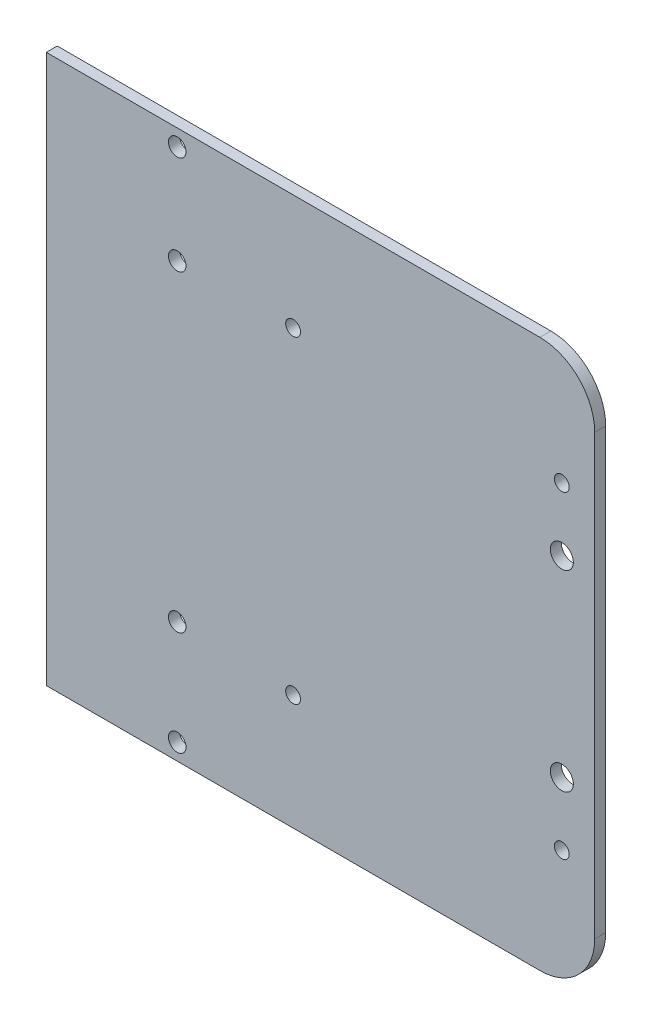
ISO-10303-21;
HEADER;
FILE_DESCRIPTION(('STEP AP214'),'2;1');
FILE_NAME('part.step','',(''),(''),'','','');
FILE_SCHEMA(('AUTOMOTIVE_DESIGN { 1 0 10303 214 1 1 1 1 }'));
ENDSEC;
DATA;
#1=APPLICATION_CONTEXT('core data for automotive mechanical design processes');
#2=APPLICATION_PROTOCOL_DEFINITION('international standard','automotive_design',2000,#1);
#3=PRODUCT_CONTEXT('',#1,'mechanical');
#4=PRODUCT('Part','Part','',(#3));
#5=PRODUCT_RELATED_PRODUCT_CATEGORY('part','',(#4));
#6=PRODUCT_DEFINITION_FORMATION('','',#4);
#7=PRODUCT_DEFINITION_CONTEXT('part definition',#1,'design');
#8=PRODUCT_DEFINITION('design','',#6,#7);
#9=PRODUCT_DEFINITION_SHAPE('','',#8);
#10=(LENGTH_UNIT() NAMED_UNIT(*) SI_UNIT(.MILLI.,.METRE.));
#11=(NAMED_UNIT(*) PLANE_ANGLE_UNIT() SI_UNIT($,.RADIAN.));
#12=(NAMED_UNIT(*) SI_UNIT($,.STERADIAN.) SOLID_ANGLE_UNIT());
#13=UNCERTAINTY_MEASURE_WITH_UNIT(LENGTH_MEASURE(1.E-05),#10,'distance_accuracy_value','');
#14=(GEOMETRIC_REPRESENTATION_CONTEXT(3) GLOBAL_UNCERTAINTY_ASSIGNED_CONTEXT((#13)) GLOBAL_UNIT_ASSIGNED_CONTEXT((#10,
#11,#12)) REPRESENTATION_CONTEXT('',''));
#15=CARTESIAN_POINT('',(0.,0.,0.));
#16=DIRECTION('',(0.,0.,1.));
#17=DIRECTION('',(1.,0.,0.));
#18=AXIS2_PLACEMENT_3D('',#15,#16,#17);
#19=CARTESIAN_POINT('',(40.,-40.,2.));
#20=DIRECTION('',(0.,0.,-1.));
#21=DIRECTION('',(-1.,0.,0.));
#22=AXIS2_PLACEMENT_3D('',#19,#20,#21);
#23=PLANE('',#22);
#24=CARTESIAN_POINT('',(-26.1250000000126,-47.,2.));
#25=DIRECTION('',(0.,0.,-1.));
#26=DIRECTION('',(-1.,0.,0.));
#27=AXIS2_PLACEMENT_3D('',#24,#25,#26);
#28=CIRCLE('',#27,1.6);
#29=CARTESIAN_POINT('',(-27.7250000000126,-47.,2.));
#30=VERTEX_POINT('',#29);
#31=EDGE_CURVE('E163',#30,#30,#28,.T.);
#32=ORIENTED_EDGE('',*,*,#31,.T.);
#33=EDGE_LOOP('',(#32));
#34=FACE_BOUND('',#33,.T.);
#35=CARTESIAN_POINT('',(-26.1250000000126,-28.0000000000001,2.));
#36=DIRECTION('',(0.,0.,-1.));
#37=DIRECTION('',(-1.,0.,0.));
#38=AXIS2_PLACEMENT_3D('',#35,#36,#37);
#39=CIRCLE('',#38,1.6);
#40=CARTESIAN_POINT('',(-27.7250000000126,-28.0000000000001,2.));
#41=VERTEX_POINT('',#40);
#42=EDGE_CURVE('E263',#41,#41,#39,.T.);
#43=ORIENTED_EDGE('',*,*,#42,.T.);
#44=EDGE_LOOP('',(#43));
#45=FACE_BOUND('',#44,.T.);
#46=CARTESIAN_POINT('',(-26.1250000000118,29.,2.));
#47=DIRECTION('',(0.,0.,-1.));
#48=DIRECTION('',(-1.,0.,0.));
#49=AXIS2_PLACEMENT_3D('',#46,#47,#48);
#50=CIRCLE('',#49,1.6);
#51=CARTESIAN_POINT('',(-27.7250000000118,29.,2.));
#52=VERTEX_POINT('',#51);
#53=EDGE_CURVE('E278',#52,#52,#50,.T.);
#54=ORIENTED_EDGE('',*,*,#53,.T.);
#55=EDGE_LOOP('',(#54));
#56=FACE_BOUND('',#55,.T.);
#57=CARTESIAN_POINT('',(-26.1250000000118,47.,2.));
#58=DIRECTION('',(0.,0.,-1.));
#59=DIRECTION('',(-1.,0.,0.));
#60=AXIS2_PLACEMENT_3D('',#57,#58,#59);
#61=CIRCLE('',#60,1.6);
#62=CARTESIAN_POINT('',(-27.7250000000118,47.,2.));
#63=VERTEX_POINT('',#62);
#64=EDGE_CURVE('E283',#63,#63,#61,.T.);
#65=ORIENTED_EDGE('',*,*,#64,.T.);
#66=EDGE_LOOP('',(#65));
#67=FACE_BOUND('',#66,.T.);
#68=CARTESIAN_POINT('',(44.,-29.,2.));
#69=DIRECTION('',(0.,0.,1.));
#70=DIRECTION('',(1.,0.,0.));
#71=AXIS2_PLACEMENT_3D('',#68,#69,#70);
#72=CIRCLE('',#71,1.35000000000001);
#73=CARTESIAN_POINT('',(45.35,-29.,2.));
#74=VERTEX_POINT('',#73);
#75=EDGE_CURVE('E156',#74,#74,#72,.F.);
#76=ORIENTED_EDGE('',*,*,#75,.T.);
#77=EDGE_LOOP('',(#76));
#78=FACE_BOUND('',#77,.T.);
#79=CARTESIAN_POINT('',(-4.99999999999998,29.,2.));
#80=DIRECTION('',(0.,0.,1.));
#81=DIRECTION('',(1.,0.,0.));
#82=AXIS2_PLACEMENT_3D('',#79,#80,#81);
#83=CIRCLE('',#82,1.35000000000001);
#84=CARTESIAN_POINT('',(-3.64999999999998,29.,2.));
#85=VERTEX_POINT('',#84);
#86=EDGE_CURVE('E174',#85,#85,#83,.F.);
#87=ORIENTED_EDGE('',*,*,#86,.T.);
#88=EDGE_LOOP('',(#87));
#89=FACE_BOUND('',#88,.T.);
#90=DIRECTION('',(0.,-1.,0.));
#91=VECTOR('',#90,1.);
#92=CARTESIAN_POINT('',(-50.,50.,2.));
#93=LINE('',#92,#91);
#94=CARTESIAN_POINT('',(-50.,50.,2.));
#95=VERTEX_POINT('',#94);
#96=CARTESIAN_POINT('',(-50.,-50.,2.));
#97=VERTEX_POINT('',#96);
#98=EDGE_CURVE('E143',#95,#97,#93,.T.);
#99=ORIENTED_EDGE('',*,*,#98,.T.);
#100=DIRECTION('',(1.,0.,0.));
#101=VECTOR('',#100,1.);
#102=CARTESIAN_POINT('',(-50.,-50.,2.));
#103=LINE('',#102,#101);
#104=CARTESIAN_POINT('',(39.9999999999999,-50.,2.));
#105=VERTEX_POINT('',#104);
#106=EDGE_CURVE('E93',#97,#105,#103,.T.);
#107=ORIENTED_EDGE('',*,*,#106,.T.);
#108=CARTESIAN_POINT('',(40.,-40.,2.));
#109=DIRECTION('',(0.,0.,1.));
#110=DIRECTION('',(-1.,0.,0.));
#111=AXIS2_PLACEMENT_3D('',#108,#109,#110);
#112=CIRCLE('',#111,10.);
#113=CARTESIAN_POINT('',(50.,-39.9999999999999,2.));
#114=VERTEX_POINT('',#113);
#115=EDGE_CURVE('E106',#105,#114,#112,.T.);
#116=ORIENTED_EDGE('',*,*,#115,.T.);
#117=DIRECTION('',(0.,1.,0.));
#118=VECTOR('',#117,1.);
#119=CARTESIAN_POINT('',(50.,39.9999999999999,2.));
#120=LINE('',#119,#118);
#121=CARTESIAN_POINT('',(50.,39.9999999999999,2.));
#122=VERTEX_POINT('',#121);
#123=EDGE_CURVE('E100',#114,#122,#120,.T.);
#124=ORIENTED_EDGE('',*,*,#123,.T.);
#125=CARTESIAN_POINT('',(40.,40.,2.));
#126=DIRECTION('',(0.,0.,1.));
#127=DIRECTION('',(-1.,0.,0.));
#128=AXIS2_PLACEMENT_3D('',#125,#126,#127);
#129=CIRCLE('',#128,10.);
#130=CARTESIAN_POINT('',(39.9999999999999,50.,2.));
#131=VERTEX_POINT('',#130);
#132=EDGE_CURVE('E104',#122,#131,#129,.T.);
#133=ORIENTED_EDGE('',*,*,#132,.T.);
#134=DIRECTION('',(-1.,0.,0.));
#135=VECTOR('',#134,1.);
#136=CARTESIAN_POINT('',(-50.,50.,2.));
#137=LINE('',#136,#135);
#138=EDGE_CURVE('E56',#131,#95,#137,.T.);
#139=ORIENTED_EDGE('',*,*,#138,.T.);
#140=EDGE_LOOP('',(#99,#107,#116,#124,#133,#139));
#141=FACE_BOUND('',#140,.T.);
#142=CARTESIAN_POINT('',(-4.99999999999998,-29.,2.));
#143=DIRECTION('',(0.,0.,1.));
#144=DIRECTION('',(1.,0.,0.));
#145=AXIS2_PLACEMENT_3D('',#142,#143,#144);
#146=CIRCLE('',#145,1.35000000000001);
#147=CARTESIAN_POINT('',(-3.64999999999998,-29.,2.));
#148=VERTEX_POINT('',#147);
#149=EDGE_CURVE('E173',#148,#148,#146,.T.);
#150=ORIENTED_EDGE('',*,*,#149,.F.);
#151=EDGE_LOOP('',(#150));
#152=FACE_BOUND('',#151,.T.);
#153=CARTESIAN_POINT('',(44.,29.,2.));
#154=DIRECTION('',(0.,0.,1.));
#155=DIRECTION('',(1.,0.,0.));
#156=AXIS2_PLACEMENT_3D('',#153,#154,#155);
#157=CIRCLE('',#156,1.35000000000001);
#158=CARTESIAN_POINT('',(45.35,29.,2.));
#159=VERTEX_POINT('',#158);
#160=EDGE_CURVE('E181',#159,#159,#157,.T.);
#161=ORIENTED_EDGE('',*,*,#160,.F.);
#162=EDGE_LOOP('',(#161));
#163=FACE_BOUND('',#162,.T.);
#164=CARTESIAN_POINT('',(44.,-17.5,2.));
#165=DIRECTION('',(0.,0.,1.));
#166=DIRECTION('',(1.,0.,0.));
#167=AXIS2_PLACEMENT_3D('',#164,#165,#166);
#168=CIRCLE('',#167,2.09999999999999);
#169=CARTESIAN_POINT('',(46.1,-17.5,2.));
#170=VERTEX_POINT('',#169);
#171=EDGE_CURVE('E158',#170,#170,#168,.F.);
#172=ORIENTED_EDGE('',*,*,#171,.T.);
#173=EDGE_LOOP('',(#172));
#174=FACE_BOUND('',#173,.T.);
#175=CARTESIAN_POINT('',(44.,17.5,2.));
#176=DIRECTION('',(0.,0.,1.));
#177=DIRECTION('',(1.,0.,0.));
#178=AXIS2_PLACEMENT_3D('',#175,#176,#177);
#179=CIRCLE('',#178,2.1);
#180=CARTESIAN_POINT('',(46.1,17.5,2.));
#181=VERTEX_POINT('',#180);
#182=EDGE_CURVE('E152',#181,#181,#179,.T.);
#183=ORIENTED_EDGE('',*,*,#182,.F.);
#184=EDGE_LOOP('',(#183));
#185=FACE_BOUND('',#184,.T.);
#186=ADVANCED_FACE('F36',(#34,#45,#56,#67,#78,#89,#141,#152,#163,#174,#185),#23,.F.);
#187=CARTESIAN_POINT('',(40.,-40.,0.));
#188=DIRECTION('',(0.,0.,-1.));
#189=DIRECTION('',(-1.,0.,0.));
#190=AXIS2_PLACEMENT_3D('',#187,#188,#189);
#191=PLANE('',#190);
#192=CARTESIAN_POINT('',(-26.1250000000126,-47.,0.));
#193=DIRECTION('',(0.,0.,-1.));
#194=DIRECTION('',(-1.,0.,0.));
#195=AXIS2_PLACEMENT_3D('',#192,#193,#194);
#196=CIRCLE('',#195,1.6);
#197=CARTESIAN_POINT('',(-27.7250000000126,-47.,0.));
#198=VERTEX_POINT('',#197);
#199=EDGE_CURVE('E262',#198,#198,#196,.T.);
#200=ORIENTED_EDGE('',*,*,#199,.F.);
#201=EDGE_LOOP('',(#200));
#202=FACE_BOUND('',#201,.T.);
#203=CARTESIAN_POINT('',(-26.1250000000126,-28.0000000000001,0.));
#204=DIRECTION('',(0.,0.,-1.));
#205=DIRECTION('',(-1.,0.,0.));
#206=AXIS2_PLACEMENT_3D('',#203,#204,#205);
#207=CIRCLE('',#206,1.6);
#208=CARTESIAN_POINT('',(-27.7250000000126,-28.0000000000001,0.));
#209=VERTEX_POINT('',#208);
#210=EDGE_CURVE('E267',#209,#209,#207,.T.);
#211=ORIENTED_EDGE('',*,*,#210,.F.);
#212=EDGE_LOOP('',(#211));
#213=FACE_BOUND('',#212,.T.);
#214=CARTESIAN_POINT('',(-26.1250000000118,29.,0.));
#215=DIRECTION('',(0.,0.,-1.));
#216=DIRECTION('',(-1.,0.,0.));
#217=AXIS2_PLACEMENT_3D('',#214,#215,#216);
#218=CIRCLE('',#217,1.6);
#219=CARTESIAN_POINT('',(-27.7250000000118,29.,0.));
#220=VERTEX_POINT('',#219);
#221=EDGE_CURVE('E280',#220,#220,#218,.T.);
#222=ORIENTED_EDGE('',*,*,#221,.F.);
#223=EDGE_LOOP('',(#222));
#224=FACE_BOUND('',#223,.T.);
#225=CARTESIAN_POINT('',(-26.1250000000118,47.,0.));
#226=DIRECTION('',(0.,0.,-1.));
#227=DIRECTION('',(-1.,0.,0.));
#228=AXIS2_PLACEMENT_3D('',#225,#226,#227);
#229=CIRCLE('',#228,1.6);
#230=CARTESIAN_POINT('',(-27.7250000000118,47.,0.));
#231=VERTEX_POINT('',#230);
#232=EDGE_CURVE('E166',#231,#231,#229,.T.);
#233=ORIENTED_EDGE('',*,*,#232,.F.);
#234=EDGE_LOOP('',(#233));
#235=FACE_BOUND('',#234,.T.);
#236=CARTESIAN_POINT('',(44.,-17.5,0.));
#237=DIRECTION('',(0.,0.,-1.));
#238=DIRECTION('',(-1.,0.,0.));
#239=AXIS2_PLACEMENT_3D('',#236,#237,#238);
#240=CIRCLE('',#239,2.09999999999999);
#241=CARTESIAN_POINT('',(41.9,-17.5,0.));
#242=VERTEX_POINT('',#241);
#243=EDGE_CURVE('E150',#242,#242,#240,.F.);
#244=ORIENTED_EDGE('',*,*,#243,.T.);
#245=EDGE_LOOP('',(#244));
#246=FACE_BOUND('',#245,.T.);
#247=CARTESIAN_POINT('',(-4.99999999999998,29.,0.));
#248=DIRECTION('',(0.,0.,1.));
#249=DIRECTION('',(1.,0.,0.));
#250=AXIS2_PLACEMENT_3D('',#247,#248,#249);
#251=CIRCLE('',#250,1.35000000000001);
#252=CARTESIAN_POINT('',(-3.64999999999998,29.,0.));
#253=VERTEX_POINT('',#252);
#254=EDGE_CURVE('E170',#253,#253,#251,.F.);
#255=ORIENTED_EDGE('',*,*,#254,.F.);
#256=EDGE_LOOP('',(#255));
#257=FACE_BOUND('',#256,.T.);
#258=CARTESIAN_POINT('',(-4.99999999999998,-29.,0.));
#259=DIRECTION('',(0.,0.,1.));
#260=DIRECTION('',(1.,0.,0.));
#261=AXIS2_PLACEMENT_3D('',#258,#259,#260);
#262=CIRCLE('',#261,1.35000000000001);
#263=CARTESIAN_POINT('',(-3.64999999999998,-29.,0.));
#264=VERTEX_POINT('',#263);
#265=EDGE_CURVE('E129',#264,#264,#262,.T.);
#266=ORIENTED_EDGE('',*,*,#265,.T.);
#267=EDGE_LOOP('',(#266));
#268=FACE_BOUND('',#267,.T.);
#269=DIRECTION('',(0.,-1.,0.));
#270=VECTOR('',#269,1.);
#271=CARTESIAN_POINT('',(-50.,50.,0.));
#272=LINE('',#271,#270);
#273=CARTESIAN_POINT('',(-50.,50.,0.));
#274=VERTEX_POINT('',#273);
#275=CARTESIAN_POINT('',(-50.,-50.,0.));
#276=VERTEX_POINT('',#275);
#277=EDGE_CURVE('E124',#274,#276,#272,.T.);
#278=ORIENTED_EDGE('',*,*,#277,.F.);
#279=DIRECTION('',(-1.,0.,0.));
#280=VECTOR('',#279,1.);
#281=CARTESIAN_POINT('',(-50.,50.,0.));
#282=LINE('',#281,#280);
#283=CARTESIAN_POINT('',(39.9999999999999,50.,0.));
#284=VERTEX_POINT('',#283);
#285=EDGE_CURVE('E85',#284,#274,#282,.T.);
#286=ORIENTED_EDGE('',*,*,#285,.F.);
#287=CARTESIAN_POINT('',(40.,40.,0.));
#288=DIRECTION('',(0.,0.,1.));
#289=DIRECTION('',(-1.,0.,0.));
#290=AXIS2_PLACEMENT_3D('',#287,#288,#289);
#291=CIRCLE('',#290,10.);
#292=CARTESIAN_POINT('',(50.,39.9999999999999,0.));
#293=VERTEX_POINT('',#292);
#294=EDGE_CURVE('E79',#293,#284,#291,.T.);
#295=ORIENTED_EDGE('',*,*,#294,.F.);
#296=DIRECTION('',(0.,1.,0.));
#297=VECTOR('',#296,1.);
#298=CARTESIAN_POINT('',(50.,39.9999999999999,0.));
#299=LINE('',#298,#297);
#300=CARTESIAN_POINT('',(50.,-39.9999999999999,0.));
#301=VERTEX_POINT('',#300);
#302=EDGE_CURVE('E114',#301,#293,#299,.T.);
#303=ORIENTED_EDGE('',*,*,#302,.F.);
#304=CARTESIAN_POINT('',(40.,-40.,0.));
#305=DIRECTION('',(0.,0.,1.));
#306=DIRECTION('',(-1.,0.,0.));
#307=AXIS2_PLACEMENT_3D('',#304,#305,#306);
#308=CIRCLE('',#307,10.);
#309=CARTESIAN_POINT('',(39.9999999999999,-50.,0.));
#310=VERTEX_POINT('',#309);
#311=EDGE_CURVE('E185',#310,#301,#308,.T.);
#312=ORIENTED_EDGE('',*,*,#311,.F.);
#313=DIRECTION('',(1.,0.,0.));
#314=VECTOR('',#313,1.);
#315=CARTESIAN_POINT('',(-50.,-50.,0.));
#316=LINE('',#315,#314);
#317=EDGE_CURVE('E128',#276,#310,#316,.T.);
#318=ORIENTED_EDGE('',*,*,#317,.F.);
#319=EDGE_LOOP('',(#278,#286,#295,#303,#312,#318));
#320=FACE_BOUND('',#319,.T.);
#321=CARTESIAN_POINT('',(44.,29.,0.));
#322=DIRECTION('',(0.,0.,1.));
#323=DIRECTION('',(1.,0.,0.));
#324=AXIS2_PLACEMENT_3D('',#321,#322,#323);
#325=CIRCLE('',#324,1.35000000000001);
#326=CARTESIAN_POINT('',(45.35,29.,0.));
#327=VERTEX_POINT('',#326);
#328=EDGE_CURVE('E177',#327,#327,#325,.T.);
#329=ORIENTED_EDGE('',*,*,#328,.T.);
#330=EDGE_LOOP('',(#329));
#331=FACE_BOUND('',#330,.T.);
#332=CARTESIAN_POINT('',(44.,-29.,0.));
#333=DIRECTION('',(0.,0.,1.));
#334=DIRECTION('',(1.,0.,0.));
#335=AXIS2_PLACEMENT_3D('',#332,#333,#334);
#336=CIRCLE('',#335,1.35000000000001);
#337=CARTESIAN_POINT('',(45.35,-29.,0.));
#338=VERTEX_POINT('',#337);
#339=EDGE_CURVE('E303',#338,#338,#336,.F.);
#340=ORIENTED_EDGE('',*,*,#339,.F.);
#341=EDGE_LOOP('',(#340));
#342=FACE_BOUND('',#341,.T.);
#343=CARTESIAN_POINT('',(44.,17.5,0.));
#344=DIRECTION('',(0.,0.,-1.));
#345=DIRECTION('',(-1.,0.,0.));
#346=AXIS2_PLACEMENT_3D('',#343,#344,#345);
#347=CIRCLE('',#346,2.1);
#348=CARTESIAN_POINT('',(41.9,17.5,0.));
#349=VERTEX_POINT('',#348);
#350=EDGE_CURVE('E40',#349,#349,#347,.T.);
#351=ORIENTED_EDGE('',*,*,#350,.F.);
#352=EDGE_LOOP('',(#351));
#353=FACE_BOUND('',#352,.T.);
#354=ADVANCED_FACE('F195',(#202,#213,#224,#235,#246,#257,#268,#320,#331,#342,#353),#191,.T.);
#355=CARTESIAN_POINT('',(-50.,50.,2.));
#356=DIRECTION('',(1.,0.,0.));
#357=DIRECTION('',(0.,1.,0.));
#358=AXIS2_PLACEMENT_3D('',#355,#356,#357);
#359=PLANE('',#358);
#360=ORIENTED_EDGE('',*,*,#277,.T.);
#361=DIRECTION('',(0.,0.,-1.));
#362=VECTOR('',#361,1.);
#363=CARTESIAN_POINT('',(-50.,-50.,2.));
#364=LINE('',#363,#362);
#365=EDGE_CURVE('E12',#97,#276,#364,.T.);
#366=ORIENTED_EDGE('',*,*,#365,.F.);
#367=ORIENTED_EDGE('',*,*,#98,.F.);
#368=DIRECTION('',(0.,0.,-1.));
#369=VECTOR('',#368,1.);
#370=CARTESIAN_POINT('',(-50.,50.,2.));
#371=LINE('',#370,#369);
#372=EDGE_CURVE('E120',#95,#274,#371,.T.);
#373=ORIENTED_EDGE('',*,*,#372,.T.);
#374=EDGE_LOOP('',(#360,#366,#367,#373));
#375=FACE_BOUND('',#374,.T.);
#376=ADVANCED_FACE('F38',(#375),#359,.F.);
#377=CARTESIAN_POINT('',(-50.,-50.,2.));
#378=DIRECTION('',(0.,1.,0.));
#379=DIRECTION('',(0.,0.,1.));
#380=AXIS2_PLACEMENT_3D('',#377,#378,#379);
#381=PLANE('',#380);
#382=ORIENTED_EDGE('',*,*,#317,.T.);
#383=DIRECTION('',(0.,0.,-1.));
#384=VECTOR('',#383,1.);
#385=CARTESIAN_POINT('',(39.9999999999999,-50.,2.));
#386=LINE('',#385,#384);
#387=EDGE_CURVE('E47',#105,#310,#386,.T.);
#388=ORIENTED_EDGE('',*,*,#387,.F.);
#389=ORIENTED_EDGE('',*,*,#106,.F.);
#390=ORIENTED_EDGE('',*,*,#365,.T.);
#391=EDGE_LOOP('',(#382,#388,#389,#390));
#392=FACE_BOUND('',#391,.T.);
#393=ADVANCED_FACE('F190',(#392),#381,.F.);
#394=CARTESIAN_POINT('',(40.,-40.,2.));
#395=DIRECTION('',(0.,0.,-1.));
#396=DIRECTION('',(-1.,0.,0.));
#397=AXIS2_PLACEMENT_3D('',#394,#395,#396);
#398=CYLINDRICAL_SURFACE('',#397,10.);
#399=ORIENTED_EDGE('',*,*,#311,.T.);
#400=DIRECTION('',(0.,0.,-1.));
#401=VECTOR('',#400,1.);
#402=CARTESIAN_POINT('',(50.,-39.9999999999999,2.));
#403=LINE('',#402,#401);
#404=EDGE_CURVE('E115',#114,#301,#403,.T.);
#405=ORIENTED_EDGE('',*,*,#404,.F.);
#406=ORIENTED_EDGE('',*,*,#115,.F.);
#407=ORIENTED_EDGE('',*,*,#387,.T.);
#408=EDGE_LOOP('',(#399,#405,#406,#407));
#409=FACE_BOUND('',#408,.T.);
#410=ADVANCED_FACE('F194',(#409),#398,.T.);
#411=CARTESIAN_POINT('',(50.,39.9999999999999,2.));
#412=DIRECTION('',(-1.,0.,0.));
#413=DIRECTION('',(0.,-1.,0.));
#414=AXIS2_PLACEMENT_3D('',#411,#412,#413);
#415=PLANE('',#414);
#416=ORIENTED_EDGE('',*,*,#302,.T.);
#417=DIRECTION('',(0.,0.,-1.));
#418=VECTOR('',#417,1.);
#419=CARTESIAN_POINT('',(50.,39.9999999999999,2.));
#420=LINE('',#419,#418);
#421=EDGE_CURVE('E111',#122,#293,#420,.T.);
#422=ORIENTED_EDGE('',*,*,#421,.F.);
#423=ORIENTED_EDGE('',*,*,#123,.F.);
#424=ORIENTED_EDGE('',*,*,#404,.T.);
#425=EDGE_LOOP('',(#416,#422,#423,#424));
#426=FACE_BOUND('',#425,.T.);
#427=ADVANCED_FACE('F112',(#426),#415,.F.);
#428=CARTESIAN_POINT('',(40.,40.,2.));
#429=DIRECTION('',(0.,0.,-1.));
#430=DIRECTION('',(-1.,0.,0.));
#431=AXIS2_PLACEMENT_3D('',#428,#429,#430);
#432=CYLINDRICAL_SURFACE('',#431,10.);
#433=ORIENTED_EDGE('',*,*,#294,.T.);
#434=DIRECTION('',(0.,0.,-1.));
#435=VECTOR('',#434,1.);
#436=CARTESIAN_POINT('',(39.9999999999999,50.,2.));
#437=LINE('',#436,#435);
#438=EDGE_CURVE('E116',#131,#284,#437,.T.);
#439=ORIENTED_EDGE('',*,*,#438,.F.);
#440=ORIENTED_EDGE('',*,*,#132,.F.);
#441=ORIENTED_EDGE('',*,*,#421,.T.);
#442=EDGE_LOOP('',(#433,#439,#440,#441));
#443=FACE_BOUND('',#442,.T.);
#444=ADVANCED_FACE('F118',(#443),#432,.T.);
#445=CARTESIAN_POINT('',(-50.,50.,2.));
#446=DIRECTION('',(0.,-1.,0.));
#447=DIRECTION('',(0.,0.,-1.));
#448=AXIS2_PLACEMENT_3D('',#445,#446,#447);
#449=PLANE('',#448);
#450=ORIENTED_EDGE('',*,*,#285,.T.);
#451=ORIENTED_EDGE('',*,*,#372,.F.);
#452=ORIENTED_EDGE('',*,*,#138,.F.);
#453=ORIENTED_EDGE('',*,*,#438,.T.);
#454=EDGE_LOOP('',(#450,#451,#452,#453));
#455=FACE_BOUND('',#454,.T.);
#456=ADVANCED_FACE('F199',(#455),#449,.F.);
#457=CARTESIAN_POINT('',(-4.99999999999998,-29.,0.));
#458=DIRECTION('',(0.,0.,1.));
#459=DIRECTION('',(1.,0.,0.));
#460=AXIS2_PLACEMENT_3D('',#457,#458,#459);
#461=CYLINDRICAL_SURFACE('',#460,1.35000000000001);
#462=ORIENTED_EDGE('',*,*,#265,.F.);
#463=EDGE_LOOP('',(#462));
#464=FACE_BOUND('',#463,.T.);
#465=ORIENTED_EDGE('',*,*,#149,.T.);
#466=EDGE_LOOP('',(#465));
#467=FACE_BOUND('',#466,.T.);
#468=ADVANCED_FACE('F201',(#464,#467),#461,.F.);
#469=CARTESIAN_POINT('',(-4.99999999999998,29.,0.));
#470=DIRECTION('',(0.,0.,1.));
#471=DIRECTION('',(1.,0.,0.));
#472=AXIS2_PLACEMENT_3D('',#469,#470,#471);
#473=CYLINDRICAL_SURFACE('',#472,1.35000000000001);
#474=ORIENTED_EDGE('',*,*,#254,.T.);
#475=EDGE_LOOP('',(#474));
#476=FACE_BOUND('',#475,.T.);
#477=ORIENTED_EDGE('',*,*,#86,.F.);
#478=EDGE_LOOP('',(#477));
#479=FACE_BOUND('',#478,.T.);
#480=ADVANCED_FACE('F207',(#476,#479),#473,.F.);
#481=CARTESIAN_POINT('',(44.,29.,0.));
#482=DIRECTION('',(0.,0.,1.));
#483=DIRECTION('',(1.,0.,0.));
#484=AXIS2_PLACEMENT_3D('',#481,#482,#483);
#485=CYLINDRICAL_SURFACE('',#484,1.35000000000001);
#486=ORIENTED_EDGE('',*,*,#328,.F.);
#487=EDGE_LOOP('',(#486));
#488=FACE_BOUND('',#487,.T.);
#489=ORIENTED_EDGE('',*,*,#160,.T.);
#490=EDGE_LOOP('',(#489));
#491=FACE_BOUND('',#490,.T.);
#492=ADVANCED_FACE('F226',(#488,#491),#485,.F.);
#493=CARTESIAN_POINT('',(44.,-29.,0.));
#494=DIRECTION('',(0.,0.,1.));
#495=DIRECTION('',(1.,0.,0.));
#496=AXIS2_PLACEMENT_3D('',#493,#494,#495);
#497=CYLINDRICAL_SURFACE('',#496,1.35000000000001);
#498=ORIENTED_EDGE('',*,*,#339,.T.);
#499=EDGE_LOOP('',(#498));
#500=FACE_BOUND('',#499,.T.);
#501=ORIENTED_EDGE('',*,*,#75,.F.);
#502=EDGE_LOOP('',(#501));
#503=FACE_BOUND('',#502,.T.);
#504=ADVANCED_FACE('F222',(#500,#503),#497,.F.);
#505=CARTESIAN_POINT('',(44.,-17.5,-8.));
#506=DIRECTION('',(0.,0.,1.));
#507=DIRECTION('',(1.,0.,0.));
#508=AXIS2_PLACEMENT_3D('',#505,#506,#507);
#509=CYLINDRICAL_SURFACE('',#508,2.09999999999999);
#510=ORIENTED_EDGE('',*,*,#243,.F.);
#511=EDGE_LOOP('',(#510));
#512=FACE_BOUND('',#511,.T.);
#513=ORIENTED_EDGE('',*,*,#171,.F.);
#514=EDGE_LOOP('',(#513));
#515=FACE_BOUND('',#514,.T.);
#516=ADVANCED_FACE('F225',(#512,#515),#509,.F.);
#517=CARTESIAN_POINT('',(44.,17.5,-8.));
#518=DIRECTION('',(0.,0.,1.));
#519=DIRECTION('',(1.,0.,0.));
#520=AXIS2_PLACEMENT_3D('',#517,#518,#519);
#521=CYLINDRICAL_SURFACE('',#520,2.1);
#522=ORIENTED_EDGE('',*,*,#350,.T.);
#523=EDGE_LOOP('',(#522));
#524=FACE_BOUND('',#523,.T.);
#525=ORIENTED_EDGE('',*,*,#182,.T.);
#526=EDGE_LOOP('',(#525));
#527=FACE_BOUND('',#526,.T.);
#528=ADVANCED_FACE('F236',(#524,#527),#521,.F.);
#529=CARTESIAN_POINT('',(-26.1250000000118,47.,2.));
#530=DIRECTION('',(0.,0.,-1.));
#531=DIRECTION('',(-1.,0.,0.));
#532=AXIS2_PLACEMENT_3D('',#529,#530,#531);
#533=CYLINDRICAL_SURFACE('',#532,1.6);
#534=ORIENTED_EDGE('',*,*,#64,.F.);
#535=EDGE_LOOP('',(#534));
#536=FACE_BOUND('',#535,.T.);
#537=ORIENTED_EDGE('',*,*,#232,.T.);
#538=EDGE_LOOP('',(#537));
#539=FACE_BOUND('',#538,.T.);
#540=ADVANCED_FACE('F240',(#536,#539),#533,.F.);
#541=CARTESIAN_POINT('',(-26.1250000000118,29.,2.));
#542=DIRECTION('',(0.,0.,-1.));
#543=DIRECTION('',(-1.,0.,0.));
#544=AXIS2_PLACEMENT_3D('',#541,#542,#543);
#545=CYLINDRICAL_SURFACE('',#544,1.6);
#546=ORIENTED_EDGE('',*,*,#53,.F.);
#547=EDGE_LOOP('',(#546));
#548=FACE_BOUND('',#547,.T.);
#549=ORIENTED_EDGE('',*,*,#221,.T.);
#550=EDGE_LOOP('',(#549));
#551=FACE_BOUND('',#550,.T.);
#552=ADVANCED_FACE('F244',(#548,#551),#545,.F.);
#553=CARTESIAN_POINT('',(-26.1250000000126,-28.0000000000001,2.));
#554=DIRECTION('',(0.,0.,-1.));
#555=DIRECTION('',(-1.,0.,0.));
#556=AXIS2_PLACEMENT_3D('',#553,#554,#555);
#557=CYLINDRICAL_SURFACE('',#556,1.6);
#558=ORIENTED_EDGE('',*,*,#42,.F.);
#559=EDGE_LOOP('',(#558));
#560=FACE_BOUND('',#559,.T.);
#561=ORIENTED_EDGE('',*,*,#210,.T.);
#562=EDGE_LOOP('',(#561));
#563=FACE_BOUND('',#562,.T.);
#564=ADVANCED_FACE('F248',(#560,#563),#557,.F.);
#565=CARTESIAN_POINT('',(-26.1250000000126,-47.,2.));
#566=DIRECTION('',(0.,0.,-1.));
#567=DIRECTION('',(-1.,0.,0.));
#568=AXIS2_PLACEMENT_3D('',#565,#566,#567);
#569=CYLINDRICAL_SURFACE('',#568,1.6);
#570=ORIENTED_EDGE('',*,*,#31,.F.);
#571=EDGE_LOOP('',(#570));
#572=FACE_BOUND('',#571,.T.);
#573=ORIENTED_EDGE('',*,*,#199,.T.);
#574=EDGE_LOOP('',(#573));
#575=FACE_BOUND('',#574,.T.);
#576=ADVANCED_FACE('F252',(#572,#575),#569,.F.);
#577=CLOSED_SHELL('',(#186,#354,#376,#393,#410,#427,#444,#456,#468,#480,#492,#504,#516,#528,
#540,#552,#564,#576));
#578=MANIFOLD_SOLID_BREP('B2',#577);
#579=ADVANCED_BREP_SHAPE_REPRESENTATION('',(#18,#578),#14);
#580=SHAPE_DEFINITION_REPRESENTATION(#9,#579);
ENDSEC;
END-ISO-10303-21;
